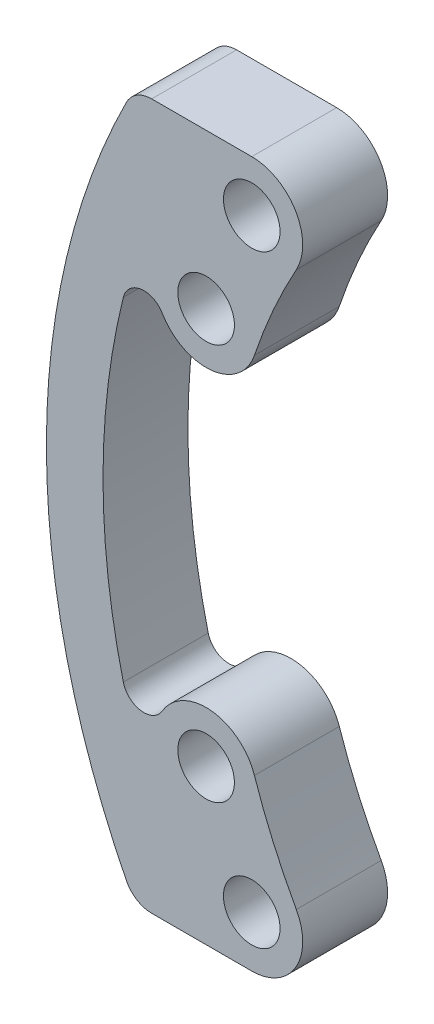
ISO-10303-21;
HEADER;
FILE_DESCRIPTION(('STEP AP214'),'2;1');
FILE_NAME('part.step','',(''),(''),'','','');
FILE_SCHEMA(('AUTOMOTIVE_DESIGN { 1 0 10303 214 1 1 1 1 }'));
ENDSEC;
DATA;
#1=APPLICATION_CONTEXT('core data for automotive mechanical design processes');
#2=APPLICATION_PROTOCOL_DEFINITION('international standard','automotive_design',2000,#1);
#3=PRODUCT_CONTEXT('',#1,'mechanical');
#4=PRODUCT('Part','Part','',(#3));
#5=PRODUCT_RELATED_PRODUCT_CATEGORY('part','',(#4));
#6=PRODUCT_DEFINITION_FORMATION('','',#4);
#7=PRODUCT_DEFINITION_CONTEXT('part definition',#1,'design');
#8=PRODUCT_DEFINITION('design','',#6,#7);
#9=PRODUCT_DEFINITION_SHAPE('','',#8);
#10=(LENGTH_UNIT() NAMED_UNIT(*) SI_UNIT(.MILLI.,.METRE.));
#11=(NAMED_UNIT(*) PLANE_ANGLE_UNIT() SI_UNIT($,.RADIAN.));
#12=(NAMED_UNIT(*) SI_UNIT($,.STERADIAN.) SOLID_ANGLE_UNIT());
#13=UNCERTAINTY_MEASURE_WITH_UNIT(LENGTH_MEASURE(1.E-05),#10,'distance_accuracy_value','');
#14=(GEOMETRIC_REPRESENTATION_CONTEXT(3) GLOBAL_UNCERTAINTY_ASSIGNED_CONTEXT((#13)) GLOBAL_UNIT_ASSIGNED_CONTEXT((#10,
#11,#12)) REPRESENTATION_CONTEXT('',''));
#15=CARTESIAN_POINT('',(0.,0.,0.));
#16=DIRECTION('',(0.,0.,1.));
#17=DIRECTION('',(1.,0.,0.));
#18=AXIS2_PLACEMENT_3D('',#15,#16,#17);
#19=CARTESIAN_POINT('',(-19.2444583804764,10.660713936792,1.5));
#20=DIRECTION('',(0.,0.,-1.));
#21=DIRECTION('',(-1.,0.,0.));
#22=AXIS2_PLACEMENT_3D('',#19,#20,#21);
#23=CYLINDRICAL_SURFACE('',#22,1.8);
#24=DIRECTION('',(0.,0.,1.));
#25=VECTOR('',#24,1.);
#26=CARTESIAN_POINT('',(-19.2444583804764,12.460713936792,-1.5));
#27=LINE('',#26,#25);
#28=CARTESIAN_POINT('',(-19.2444583804764,12.460713936792,-1.5));
#29=VERTEX_POINT('',#28);
#30=CARTESIAN_POINT('',(-19.2444583804764,12.460713936792,1.5));
#31=VERTEX_POINT('',#30);
#32=EDGE_CURVE('E187',#29,#31,#27,.T.);
#33=ORIENTED_EDGE('',*,*,#32,.T.);
#34=CARTESIAN_POINT('',(-19.2444583804764,10.660713936792,1.5));
#35=DIRECTION('',(0.,0.,1.));
#36=DIRECTION('',(1.,0.,0.));
#37=AXIS2_PLACEMENT_3D('',#34,#35,#36);
#38=CIRCLE('',#37,1.8);
#39=CARTESIAN_POINT('',(-17.6699117857101,9.78847370559995,1.5));
#40=VERTEX_POINT('',#39);
#41=EDGE_CURVE('E224',#40,#31,#38,.T.);
#42=ORIENTED_EDGE('',*,*,#41,.F.);
#43=DIRECTION('',(0.,0.,-1.));
#44=VECTOR('',#43,1.);
#45=CARTESIAN_POINT('',(-17.6699117857101,9.78847370559995,1.5));
#46=LINE('',#45,#44);
#47=CARTESIAN_POINT('',(-17.6699117857101,9.78847370559995,-1.5));
#48=VERTEX_POINT('',#47);
#49=EDGE_CURVE('E232',#40,#48,#46,.T.);
#50=ORIENTED_EDGE('',*,*,#49,.T.);
#51=CARTESIAN_POINT('',(-19.2444583804764,10.660713936792,-1.5));
#52=DIRECTION('',(0.,0.,1.));
#53=DIRECTION('',(1.,0.,0.));
#54=AXIS2_PLACEMENT_3D('',#51,#52,#53);
#55=CIRCLE('',#54,1.8);
#56=EDGE_CURVE('E221',#48,#29,#55,.T.);
#57=ORIENTED_EDGE('',*,*,#56,.T.);
#58=EDGE_LOOP('',(#33,#42,#50,#57));
#59=FACE_BOUND('',#58,.T.);
#60=ADVANCED_FACE('F33',(#59),#23,.T.);
#61=CARTESIAN_POINT('',(-20.8566536146142,7.,1.5));
#62=DIRECTION('',(0.,0.,-1.));
#63=DIRECTION('',(-1.,0.,0.));
#64=AXIS2_PLACEMENT_3D('',#61,#62,#63);
#65=CYLINDRICAL_SURFACE('',#64,1.8);
#66=DIRECTION('',(0.,0.,1.));
#67=VECTOR('',#66,1.);
#68=CARTESIAN_POINT('',(-22.4078937734295,6.08695346795534,-1.5));
#69=LINE('',#68,#67);
#70=CARTESIAN_POINT('',(-22.4078937734295,6.08695346795534,-1.5));
#71=VERTEX_POINT('',#70);
#72=CARTESIAN_POINT('',(-22.4078937734295,6.08695346795534,1.5));
#73=VERTEX_POINT('',#72);
#74=EDGE_CURVE('E198',#71,#73,#69,.T.);
#75=ORIENTED_EDGE('',*,*,#74,.F.);
#76=CARTESIAN_POINT('',(-20.8566536146142,7.,-1.5));
#77=DIRECTION('',(0.,0.,1.));
#78=DIRECTION('',(1.,0.,0.));
#79=AXIS2_PLACEMENT_3D('',#76,#77,#78);
#80=CIRCLE('',#79,1.8);
#81=CARTESIAN_POINT('',(-19.1502001370549,6.42727272727273,-1.5));
#82=VERTEX_POINT('',#81);
#83=EDGE_CURVE('E235',#71,#82,#80,.T.);
#84=ORIENTED_EDGE('',*,*,#83,.T.);
#85=DIRECTION('',(0.,0.,-1.));
#86=VECTOR('',#85,1.);
#87=CARTESIAN_POINT('',(-19.1502001370549,6.42727272727273,1.5));
#88=LINE('',#87,#86);
#89=CARTESIAN_POINT('',(-19.1502001370549,6.42727272727273,1.5));
#90=VERTEX_POINT('',#89);
#91=EDGE_CURVE('E240',#90,#82,#88,.T.);
#92=ORIENTED_EDGE('',*,*,#91,.F.);
#93=CARTESIAN_POINT('',(-20.8566536146142,7.,1.5));
#94=DIRECTION('',(0.,0.,1.));
#95=DIRECTION('',(1.,0.,0.));
#96=AXIS2_PLACEMENT_3D('',#93,#94,#95);
#97=CIRCLE('',#96,1.8);
#98=EDGE_CURVE('E227',#73,#90,#97,.T.);
#99=ORIENTED_EDGE('',*,*,#98,.F.);
#100=EDGE_LOOP('',(#75,#84,#92,#99));
#101=FACE_BOUND('',#100,.T.);
#102=ADVANCED_FACE('F293',(#101),#65,.T.);
#103=CARTESIAN_POINT('',(-9.6222291902382,5.33035696839601,1.5));
#104=DIRECTION('',(0.,0.,1.));
#105=DIRECTION('',(1.,0.,0.));
#106=AXIS2_PLACEMENT_3D('',#103,#104,#105);
#107=PLANE('',#106);
#108=CARTESIAN_POINT('',(0.,0.,1.5));
#109=DIRECTION('',(0.,0.,1.));
#110=DIRECTION('',(1.,0.,0.));
#111=AXIS2_PLACEMENT_3D('',#108,#109,#110);
#112=CIRCLE('',#111,26.5);
#113=CARTESIAN_POINT('',(-23.6727319687809,11.9101536990192,1.5));
#114=VERTEX_POINT('',#113);
#115=CARTESIAN_POINT('',(-23.6727319687809,-11.9101536990192,1.5));
#116=VERTEX_POINT('',#115);
#117=EDGE_CURVE('E167',#114,#116,#112,.T.);
#118=ORIENTED_EDGE('',*,*,#117,.T.);
#119=CARTESIAN_POINT('',(-22.7794213284495,-11.460713936792,1.5));
#120=DIRECTION('',(0.,0.,1.));
#121=DIRECTION('',(1.,0.,0.));
#122=AXIS2_PLACEMENT_3D('',#119,#120,#121);
#123=CIRCLE('',#122,1.);
#124=CARTESIAN_POINT('',(-22.7794213284495,-12.460713936792,1.5));
#125=VERTEX_POINT('',#124);
#126=EDGE_CURVE('E250',#116,#125,#123,.T.);
#127=ORIENTED_EDGE('',*,*,#126,.T.);
#128=DIRECTION('',(1.,0.,0.));
#129=VECTOR('',#128,1.);
#130=CARTESIAN_POINT('',(-19.2444583804764,-12.460713936792,1.5));
#131=LINE('',#130,#129);
#132=CARTESIAN_POINT('',(-19.2444583804764,-12.460713936792,1.5));
#133=VERTEX_POINT('',#132);
#134=EDGE_CURVE('E144',#125,#133,#131,.T.);
#135=ORIENTED_EDGE('',*,*,#134,.T.);
#136=CARTESIAN_POINT('',(-19.2444583804764,-10.660713936792,1.5));
#137=DIRECTION('',(0.,0.,1.));
#138=DIRECTION('',(-1.,0.,0.));
#139=AXIS2_PLACEMENT_3D('',#136,#137,#138);
#140=CIRCLE('',#139,1.8);
#141=CARTESIAN_POINT('',(-17.6699117857101,-9.78847370559995,1.5));
#142=VERTEX_POINT('',#141);
#143=EDGE_CURVE('E136',#133,#142,#140,.T.);
#144=ORIENTED_EDGE('',*,*,#143,.T.);
#145=CARTESIAN_POINT('',(0.,0.,1.5));
#146=DIRECTION('',(0.,0.,-1.));
#147=DIRECTION('',(-1.,0.,0.));
#148=AXIS2_PLACEMENT_3D('',#145,#146,#147);
#149=CIRCLE('',#148,20.2);
#150=CARTESIAN_POINT('',(-19.1502001370549,-6.42727272727273,1.5));
#151=VERTEX_POINT('',#150);
#152=EDGE_CURVE('E142',#142,#151,#149,.T.);
#153=ORIENTED_EDGE('',*,*,#152,.T.);
#154=CARTESIAN_POINT('',(-20.8566536146142,-7.00000000000001,1.5));
#155=DIRECTION('',(0.,0.,1.));
#156=DIRECTION('',(-1.,0.,0.));
#157=AXIS2_PLACEMENT_3D('',#154,#155,#156);
#158=CIRCLE('',#157,1.8);
#159=CARTESIAN_POINT('',(-22.4078937734295,-6.08695346795535,1.5));
#160=VERTEX_POINT('',#159);
#161=EDGE_CURVE('E158',#151,#160,#158,.T.);
#162=ORIENTED_EDGE('',*,*,#161,.T.);
#163=CARTESIAN_POINT('',(-23.0542438396025,-5.70651741293674,1.5));
#164=DIRECTION('',(0.,0.,-1.));
#165=DIRECTION('',(1.,0.,0.));
#166=AXIS2_PLACEMENT_3D('',#163,#164,#165);
#167=CIRCLE('',#166,0.749999999999999);
#168=CARTESIAN_POINT('',(-23.7822725924321,-5.88672322597684,1.5));
#169=VERTEX_POINT('',#168);
#170=EDGE_CURVE('E191',#160,#169,#167,.T.);
#171=ORIENTED_EDGE('',*,*,#170,.T.);
#172=CARTESIAN_POINT('',(0.,0.,1.5));
#173=DIRECTION('',(0.,0.,-1.));
#174=DIRECTION('',(1.,0.,0.));
#175=AXIS2_PLACEMENT_3D('',#172,#173,#174);
#176=CIRCLE('',#175,24.5);
#177=CARTESIAN_POINT('',(-23.7822725924321,5.88672322597684,1.5));
#178=VERTEX_POINT('',#177);
#179=EDGE_CURVE('E194',#169,#178,#176,.T.);
#180=ORIENTED_EDGE('',*,*,#179,.T.);
#181=CARTESIAN_POINT('',(-23.0542438396025,5.70651741293673,1.5));
#182=DIRECTION('',(0.,0.,-1.));
#183=DIRECTION('',(1.,0.,0.));
#184=AXIS2_PLACEMENT_3D('',#181,#182,#183);
#185=CIRCLE('',#184,0.750000000000001);
#186=EDGE_CURVE('E175',#178,#73,#185,.T.);
#187=ORIENTED_EDGE('',*,*,#186,.T.);
#188=ORIENTED_EDGE('',*,*,#98,.T.);
#189=CARTESIAN_POINT('',(0.,0.,1.5));
#190=DIRECTION('',(0.,0.,-1.));
#191=DIRECTION('',(1.,0.,0.));
#192=AXIS2_PLACEMENT_3D('',#189,#190,#191);
#193=CIRCLE('',#192,20.2);
#194=EDGE_CURVE('E230',#90,#40,#193,.T.);
#195=ORIENTED_EDGE('',*,*,#194,.T.);
#196=ORIENTED_EDGE('',*,*,#41,.T.);
#197=DIRECTION('',(-1.,0.,0.));
#198=VECTOR('',#197,1.);
#199=CARTESIAN_POINT('',(-19.2444583804764,12.460713936792,1.5));
#200=LINE('',#199,#198);
#201=CARTESIAN_POINT('',(-22.7794213284495,12.460713936792,1.5));
#202=VERTEX_POINT('',#201);
#203=EDGE_CURVE('E164',#31,#202,#200,.T.);
#204=ORIENTED_EDGE('',*,*,#203,.T.);
#205=CARTESIAN_POINT('',(-22.7794213284495,11.460713936792,1.5));
#206=DIRECTION('',(0.,0.,1.));
#207=DIRECTION('',(1.,0.,0.));
#208=AXIS2_PLACEMENT_3D('',#205,#206,#207);
#209=CIRCLE('',#208,1.);
#210=EDGE_CURVE('E248',#202,#114,#209,.T.);
#211=ORIENTED_EDGE('',*,*,#210,.T.);
#212=EDGE_LOOP('',(#118,#127,#135,#144,#153,#162,#171,#180,#187,#188,#195,#196,#204,#211));
#213=FACE_BOUND('',#212,.T.);
#214=CARTESIAN_POINT('',(-19.2444583804764,10.660713936792,1.5));
#215=DIRECTION('',(0.,0.,1.));
#216=DIRECTION('',(1.,0.,0.));
#217=AXIS2_PLACEMENT_3D('',#214,#215,#216);
#218=CIRCLE('',#217,0.999999999999984);
#219=CARTESIAN_POINT('',(-18.2444583804764,10.660713936792,1.5));
#220=VERTEX_POINT('',#219);
#221=EDGE_CURVE('E218',#220,#220,#218,.T.);
#222=ORIENTED_EDGE('',*,*,#221,.F.);
#223=EDGE_LOOP('',(#222));
#224=FACE_BOUND('',#223,.T.);
#225=CARTESIAN_POINT('',(-20.8566536146142,7.,1.5));
#226=DIRECTION('',(0.,0.,1.));
#227=DIRECTION('',(1.,0.,0.));
#228=AXIS2_PLACEMENT_3D('',#225,#226,#227);
#229=CIRCLE('',#228,1.);
#230=CARTESIAN_POINT('',(-19.8566536146142,7.,1.5));
#231=VERTEX_POINT('',#230);
#232=EDGE_CURVE('E212',#231,#231,#229,.T.);
#233=ORIENTED_EDGE('',*,*,#232,.F.);
#234=EDGE_LOOP('',(#233));
#235=FACE_BOUND('',#234,.T.);
#236=CARTESIAN_POINT('',(-19.2444583804764,-10.660713936792,1.5));
#237=DIRECTION('',(0.,0.,1.));
#238=DIRECTION('',(-1.,0.,0.));
#239=AXIS2_PLACEMENT_3D('',#236,#237,#238);
#240=CIRCLE('',#239,0.999999999999984);
#241=CARTESIAN_POINT('',(-20.2444583804764,-10.660713936792,1.5));
#242=VERTEX_POINT('',#241);
#243=EDGE_CURVE('E266',#242,#242,#240,.T.);
#244=ORIENTED_EDGE('',*,*,#243,.F.);
#245=EDGE_LOOP('',(#244));
#246=FACE_BOUND('',#245,.T.);
#247=CARTESIAN_POINT('',(-20.8566536146142,-7.00000000000001,1.5));
#248=DIRECTION('',(0.,0.,1.));
#249=DIRECTION('',(-1.,0.,0.));
#250=AXIS2_PLACEMENT_3D('',#247,#248,#249);
#251=CIRCLE('',#250,1.);
#252=CARTESIAN_POINT('',(-21.8566536146142,-7.00000000000001,1.5));
#253=VERTEX_POINT('',#252);
#254=EDGE_CURVE('E361',#253,#253,#251,.T.);
#255=ORIENTED_EDGE('',*,*,#254,.F.);
#256=EDGE_LOOP('',(#255));
#257=FACE_BOUND('',#256,.T.);
#258=ADVANCED_FACE('F139',(#213,#224,#235,#246,#257),#107,.T.);
#259=CARTESIAN_POINT('',(-9.6222291902382,5.33035696839601,-1.5));
#260=DIRECTION('',(0.,0.,1.));
#261=DIRECTION('',(1.,0.,0.));
#262=AXIS2_PLACEMENT_3D('',#259,#260,#261);
#263=PLANE('',#262);
#264=DIRECTION('',(1.,0.,0.));
#265=VECTOR('',#264,1.);
#266=CARTESIAN_POINT('',(-19.2444583804764,-12.460713936792,-1.5));
#267=LINE('',#266,#265);
#268=CARTESIAN_POINT('',(-22.7794213284495,-12.460713936792,-1.5));
#269=VERTEX_POINT('',#268);
#270=CARTESIAN_POINT('',(-19.2444583804764,-12.460713936792,-1.5));
#271=VERTEX_POINT('',#270);
#272=EDGE_CURVE('E178',#269,#271,#267,.T.);
#273=ORIENTED_EDGE('',*,*,#272,.F.);
#274=CARTESIAN_POINT('',(-22.7794213284495,-11.460713936792,-1.5));
#275=DIRECTION('',(0.,0.,1.));
#276=DIRECTION('',(1.,0.,0.));
#277=AXIS2_PLACEMENT_3D('',#274,#275,#276);
#278=CIRCLE('',#277,1.);
#279=CARTESIAN_POINT('',(-23.6727319687809,-11.9101536990192,-1.5));
#280=VERTEX_POINT('',#279);
#281=EDGE_CURVE('E41',#269,#280,#278,.F.);
#282=ORIENTED_EDGE('',*,*,#281,.T.);
#283=CARTESIAN_POINT('',(0.,0.,-1.5));
#284=DIRECTION('',(0.,0.,1.));
#285=DIRECTION('',(1.,0.,0.));
#286=AXIS2_PLACEMENT_3D('',#283,#284,#285);
#287=CIRCLE('',#286,26.5);
#288=CARTESIAN_POINT('',(-23.6727319687809,11.9101536990192,-1.5));
#289=VERTEX_POINT('',#288);
#290=EDGE_CURVE('E174',#289,#280,#287,.T.);
#291=ORIENTED_EDGE('',*,*,#290,.F.);
#292=CARTESIAN_POINT('',(-22.7794213284495,11.460713936792,-1.5));
#293=DIRECTION('',(0.,0.,1.));
#294=DIRECTION('',(1.,0.,0.));
#295=AXIS2_PLACEMENT_3D('',#292,#293,#294);
#296=CIRCLE('',#295,1.);
#297=CARTESIAN_POINT('',(-22.7794213284495,12.460713936792,-1.5));
#298=VERTEX_POINT('',#297);
#299=EDGE_CURVE('E48',#289,#298,#296,.F.);
#300=ORIENTED_EDGE('',*,*,#299,.T.);
#301=DIRECTION('',(-1.,0.,0.));
#302=VECTOR('',#301,1.);
#303=CARTESIAN_POINT('',(-19.2444583804764,12.460713936792,-1.5));
#304=LINE('',#303,#302);
#305=EDGE_CURVE('E172',#29,#298,#304,.T.);
#306=ORIENTED_EDGE('',*,*,#305,.F.);
#307=ORIENTED_EDGE('',*,*,#56,.F.);
#308=CARTESIAN_POINT('',(0.,0.,-1.5));
#309=DIRECTION('',(0.,0.,-1.));
#310=DIRECTION('',(1.,0.,0.));
#311=AXIS2_PLACEMENT_3D('',#308,#309,#310);
#312=CIRCLE('',#311,20.2);
#313=EDGE_CURVE('E228',#82,#48,#312,.T.);
#314=ORIENTED_EDGE('',*,*,#313,.F.);
#315=ORIENTED_EDGE('',*,*,#83,.F.);
#316=CARTESIAN_POINT('',(-23.0542438396025,5.70651741293673,-1.5));
#317=DIRECTION('',(0.,0.,-1.));
#318=DIRECTION('',(1.,0.,0.));
#319=AXIS2_PLACEMENT_3D('',#316,#317,#318);
#320=CIRCLE('',#319,0.750000000000001);
#321=CARTESIAN_POINT('',(-23.7822725924321,5.88672322597684,-1.5));
#322=VERTEX_POINT('',#321);
#323=EDGE_CURVE('E186',#322,#71,#320,.T.);
#324=ORIENTED_EDGE('',*,*,#323,.F.);
#325=CARTESIAN_POINT('',(0.,0.,-1.5));
#326=DIRECTION('',(0.,0.,-1.));
#327=DIRECTION('',(1.,0.,0.));
#328=AXIS2_PLACEMENT_3D('',#325,#326,#327);
#329=CIRCLE('',#328,24.5);
#330=CARTESIAN_POINT('',(-23.7822725924321,-5.88672322597684,-1.5));
#331=VERTEX_POINT('',#330);
#332=EDGE_CURVE('E183',#331,#322,#329,.T.);
#333=ORIENTED_EDGE('',*,*,#332,.F.);
#334=CARTESIAN_POINT('',(-23.0542438396025,-5.70651741293674,-1.5));
#335=DIRECTION('',(0.,0.,-1.));
#336=DIRECTION('',(1.,0.,0.));
#337=AXIS2_PLACEMENT_3D('',#334,#335,#336);
#338=CIRCLE('',#337,0.749999999999999);
#339=CARTESIAN_POINT('',(-22.4078937734295,-6.08695346795535,-1.5));
#340=VERTEX_POINT('',#339);
#341=EDGE_CURVE('E180',#340,#331,#338,.T.);
#342=ORIENTED_EDGE('',*,*,#341,.F.);
#343=CARTESIAN_POINT('',(-20.8566536146142,-7.00000000000001,-1.5));
#344=DIRECTION('',(0.,0.,1.));
#345=DIRECTION('',(-1.,0.,0.));
#346=AXIS2_PLACEMENT_3D('',#343,#344,#345);
#347=CIRCLE('',#346,1.8);
#348=CARTESIAN_POINT('',(-19.1502001370549,-6.42727272727273,-1.5));
#349=VERTEX_POINT('',#348);
#350=EDGE_CURVE('E149',#349,#340,#347,.T.);
#351=ORIENTED_EDGE('',*,*,#350,.F.);
#352=CARTESIAN_POINT('',(0.,0.,-1.5));
#353=DIRECTION('',(0.,0.,-1.));
#354=DIRECTION('',(-1.,0.,0.));
#355=AXIS2_PLACEMENT_3D('',#352,#353,#354);
#356=CIRCLE('',#355,20.2);
#357=CARTESIAN_POINT('',(-17.6699117857101,-9.78847370559995,-1.5));
#358=VERTEX_POINT('',#357);
#359=EDGE_CURVE('E265',#358,#349,#356,.T.);
#360=ORIENTED_EDGE('',*,*,#359,.F.);
#361=CARTESIAN_POINT('',(-19.2444583804764,-10.660713936792,-1.5));
#362=DIRECTION('',(0.,0.,1.));
#363=DIRECTION('',(-1.,0.,0.));
#364=AXIS2_PLACEMENT_3D('',#361,#362,#363);
#365=CIRCLE('',#364,1.8);
#366=EDGE_CURVE('E162',#271,#358,#365,.T.);
#367=ORIENTED_EDGE('',*,*,#366,.F.);
#368=EDGE_LOOP('',(#273,#282,#291,#300,#306,#307,#314,#315,#324,#333,#342,#351,#360,#367));
#369=FACE_BOUND('',#368,.T.);
#370=CARTESIAN_POINT('',(-19.2444583804764,10.660713936792,-1.5));
#371=DIRECTION('',(0.,0.,1.));
#372=DIRECTION('',(1.,0.,0.));
#373=AXIS2_PLACEMENT_3D('',#370,#371,#372);
#374=CIRCLE('',#373,0.999999999999984);
#375=CARTESIAN_POINT('',(-18.2444583804764,10.660713936792,-1.5));
#376=VERTEX_POINT('',#375);
#377=EDGE_CURVE('E215',#376,#376,#374,.T.);
#378=ORIENTED_EDGE('',*,*,#377,.T.);
#379=EDGE_LOOP('',(#378));
#380=FACE_BOUND('',#379,.T.);
#381=CARTESIAN_POINT('',(-20.8566536146142,7.,-1.5));
#382=DIRECTION('',(0.,0.,1.));
#383=DIRECTION('',(1.,0.,0.));
#384=AXIS2_PLACEMENT_3D('',#381,#382,#383);
#385=CIRCLE('',#384,1.);
#386=CARTESIAN_POINT('',(-19.8566536146142,7.,-1.5));
#387=VERTEX_POINT('',#386);
#388=EDGE_CURVE('E201',#387,#387,#385,.T.);
#389=ORIENTED_EDGE('',*,*,#388,.T.);
#390=EDGE_LOOP('',(#389));
#391=FACE_BOUND('',#390,.T.);
#392=CARTESIAN_POINT('',(-19.2444583804764,-10.660713936792,-1.5));
#393=DIRECTION('',(0.,0.,1.));
#394=DIRECTION('',(-1.,0.,0.));
#395=AXIS2_PLACEMENT_3D('',#392,#393,#394);
#396=CIRCLE('',#395,0.999999999999984);
#397=CARTESIAN_POINT('',(-20.2444583804764,-10.660713936792,-1.5));
#398=VERTEX_POINT('',#397);
#399=EDGE_CURVE('E270',#398,#398,#396,.T.);
#400=ORIENTED_EDGE('',*,*,#399,.T.);
#401=EDGE_LOOP('',(#400));
#402=FACE_BOUND('',#401,.T.);
#403=CARTESIAN_POINT('',(-20.8566536146142,-7.00000000000001,-1.5));
#404=DIRECTION('',(0.,0.,1.));
#405=DIRECTION('',(-1.,0.,0.));
#406=AXIS2_PLACEMENT_3D('',#403,#404,#405);
#407=CIRCLE('',#406,1.);
#408=CARTESIAN_POINT('',(-21.8566536146142,-7.00000000000001,-1.5));
#409=VERTEX_POINT('',#408);
#410=EDGE_CURVE('E364',#409,#409,#407,.T.);
#411=ORIENTED_EDGE('',*,*,#410,.T.);
#412=EDGE_LOOP('',(#411));
#413=FACE_BOUND('',#412,.T.);
#414=ADVANCED_FACE('F254',(#369,#380,#391,#402,#413),#263,.F.);
#415=CARTESIAN_POINT('',(0.,0.,1.5));
#416=DIRECTION('',(0.,0.,-1.));
#417=DIRECTION('',(-1.,0.,0.));
#418=AXIS2_PLACEMENT_3D('',#415,#416,#417);
#419=CYLINDRICAL_SURFACE('',#418,20.2);
#420=ORIENTED_EDGE('',*,*,#313,.T.);
#421=ORIENTED_EDGE('',*,*,#49,.F.);
#422=ORIENTED_EDGE('',*,*,#194,.F.);
#423=ORIENTED_EDGE('',*,*,#91,.T.);
#424=EDGE_LOOP('',(#420,#421,#422,#423));
#425=FACE_BOUND('',#424,.T.);
#426=ADVANCED_FACE('F298',(#425),#419,.F.);
#427=CARTESIAN_POINT('',(-19.2444583804764,10.660713936792,1.5));
#428=DIRECTION('',(0.,0.,-1.));
#429=DIRECTION('',(-1.,0.,0.));
#430=AXIS2_PLACEMENT_3D('',#427,#428,#429);
#431=CYLINDRICAL_SURFACE('',#430,0.999999999999984);
#432=ORIENTED_EDGE('',*,*,#221,.T.);
#433=EDGE_LOOP('',(#432));
#434=FACE_BOUND('',#433,.T.);
#435=ORIENTED_EDGE('',*,*,#377,.F.);
#436=EDGE_LOOP('',(#435));
#437=FACE_BOUND('',#436,.T.);
#438=ADVANCED_FACE('F320',(#434,#437),#431,.F.);
#439=CARTESIAN_POINT('',(-20.8566536146142,7.,1.5));
#440=DIRECTION('',(0.,0.,-1.));
#441=DIRECTION('',(-1.,0.,0.));
#442=AXIS2_PLACEMENT_3D('',#439,#440,#441);
#443=CYLINDRICAL_SURFACE('',#442,1.);
#444=ORIENTED_EDGE('',*,*,#232,.T.);
#445=EDGE_LOOP('',(#444));
#446=FACE_BOUND('',#445,.T.);
#447=ORIENTED_EDGE('',*,*,#388,.F.);
#448=EDGE_LOOP('',(#447));
#449=FACE_BOUND('',#448,.T.);
#450=ADVANCED_FACE('F327',(#446,#449),#443,.F.);
#451=CARTESIAN_POINT('',(-23.0542438396025,5.70651741293673,-1.5));
#452=DIRECTION('',(0.,0.,1.));
#453=DIRECTION('',(1.,0.,0.));
#454=AXIS2_PLACEMENT_3D('',#451,#452,#453);
#455=CYLINDRICAL_SURFACE('',#454,0.750000000000001);
#456=ORIENTED_EDGE('',*,*,#186,.F.);
#457=DIRECTION('',(0.,0.,1.));
#458=VECTOR('',#457,1.);
#459=CARTESIAN_POINT('',(-23.7822725924321,5.88672322597684,-1.5));
#460=LINE('',#459,#458);
#461=EDGE_CURVE('E202',#322,#178,#460,.T.);
#462=ORIENTED_EDGE('',*,*,#461,.F.);
#463=ORIENTED_EDGE('',*,*,#323,.T.);
#464=ORIENTED_EDGE('',*,*,#74,.T.);
#465=EDGE_LOOP('',(#456,#462,#463,#464));
#466=FACE_BOUND('',#465,.T.);
#467=ADVANCED_FACE('F288',(#466),#455,.F.);
#468=CARTESIAN_POINT('',(0.,0.,-1.5));
#469=DIRECTION('',(0.,0.,1.));
#470=DIRECTION('',(1.,0.,0.));
#471=AXIS2_PLACEMENT_3D('',#468,#469,#470);
#472=CYLINDRICAL_SURFACE('',#471,24.5);
#473=ORIENTED_EDGE('',*,*,#179,.F.);
#474=DIRECTION('',(0.,0.,1.));
#475=VECTOR('',#474,1.);
#476=CARTESIAN_POINT('',(-23.7822725924321,-5.88672322597684,-1.5));
#477=LINE('',#476,#475);
#478=EDGE_CURVE('E204',#331,#169,#477,.T.);
#479=ORIENTED_EDGE('',*,*,#478,.F.);
#480=ORIENTED_EDGE('',*,*,#332,.T.);
#481=ORIENTED_EDGE('',*,*,#461,.T.);
#482=EDGE_LOOP('',(#473,#479,#480,#481));
#483=FACE_BOUND('',#482,.T.);
#484=ADVANCED_FACE('F285',(#483),#472,.F.);
#485=CARTESIAN_POINT('',(-23.0542438396025,-5.70651741293674,-1.5));
#486=DIRECTION('',(0.,0.,1.));
#487=DIRECTION('',(1.,0.,0.));
#488=AXIS2_PLACEMENT_3D('',#485,#486,#487);
#489=CYLINDRICAL_SURFACE('',#488,0.749999999999999);
#490=ORIENTED_EDGE('',*,*,#170,.F.);
#491=DIRECTION('',(0.,0.,1.));
#492=VECTOR('',#491,1.);
#493=CARTESIAN_POINT('',(-22.4078937734295,-6.08695346795534,-1.5));
#494=LINE('',#493,#492);
#495=EDGE_CURVE('E206',#340,#160,#494,.T.);
#496=ORIENTED_EDGE('',*,*,#495,.F.);
#497=ORIENTED_EDGE('',*,*,#341,.T.);
#498=ORIENTED_EDGE('',*,*,#478,.T.);
#499=EDGE_LOOP('',(#490,#496,#497,#498));
#500=FACE_BOUND('',#499,.T.);
#501=ADVANCED_FACE('F279',(#500),#489,.F.);
#502=CARTESIAN_POINT('',(-19.2444583804764,-12.460713936792,-1.5));
#503=DIRECTION('',(0.,-1.,0.));
#504=DIRECTION('',(0.,0.,-1.));
#505=AXIS2_PLACEMENT_3D('',#502,#503,#504);
#506=PLANE('',#505);
#507=ORIENTED_EDGE('',*,*,#134,.F.);
#508=DIRECTION('',(0.,0.,1.));
#509=VECTOR('',#508,1.);
#510=CARTESIAN_POINT('',(-22.7794213284495,-12.460713936792,-1.5));
#511=LINE('',#510,#509);
#512=EDGE_CURVE('E56',#125,#269,#511,.F.);
#513=ORIENTED_EDGE('',*,*,#512,.T.);
#514=ORIENTED_EDGE('',*,*,#272,.T.);
#515=DIRECTION('',(0.,0.,1.));
#516=VECTOR('',#515,1.);
#517=CARTESIAN_POINT('',(-19.2444583804764,-12.460713936792,-1.5));
#518=LINE('',#517,#516);
#519=EDGE_CURVE('E208',#271,#133,#518,.T.);
#520=ORIENTED_EDGE('',*,*,#519,.T.);
#521=EDGE_LOOP('',(#507,#513,#514,#520));
#522=FACE_BOUND('',#521,.T.);
#523=ADVANCED_FACE('F263',(#522),#506,.T.);
#524=CARTESIAN_POINT('',(0.,0.,-1.5));
#525=DIRECTION('',(0.,0.,1.));
#526=DIRECTION('',(1.,0.,0.));
#527=AXIS2_PLACEMENT_3D('',#524,#525,#526);
#528=CYLINDRICAL_SURFACE('',#527,26.5);
#529=ORIENTED_EDGE('',*,*,#290,.T.);
#530=DIRECTION('',(0.,0.,1.));
#531=VECTOR('',#530,1.);
#532=CARTESIAN_POINT('',(-23.6727319687809,-11.9101536990192,-1.5));
#533=LINE('',#532,#531);
#534=EDGE_CURVE('E245',#280,#116,#533,.T.);
#535=ORIENTED_EDGE('',*,*,#534,.T.);
#536=ORIENTED_EDGE('',*,*,#117,.F.);
#537=DIRECTION('',(0.,0.,1.));
#538=VECTOR('',#537,1.);
#539=CARTESIAN_POINT('',(-23.6727319687809,11.9101536990192,-1.5));
#540=LINE('',#539,#538);
#541=EDGE_CURVE('E243',#114,#289,#540,.F.);
#542=ORIENTED_EDGE('',*,*,#541,.T.);
#543=EDGE_LOOP('',(#529,#535,#536,#542));
#544=FACE_BOUND('',#543,.T.);
#545=ADVANCED_FACE('F259',(#544),#528,.T.);
#546=CARTESIAN_POINT('',(-19.2444583804764,12.460713936792,-1.5));
#547=DIRECTION('',(0.,1.,0.));
#548=DIRECTION('',(-1.,0.,0.));
#549=AXIS2_PLACEMENT_3D('',#546,#547,#548);
#550=PLANE('',#549);
#551=ORIENTED_EDGE('',*,*,#305,.T.);
#552=DIRECTION('',(0.,0.,1.));
#553=VECTOR('',#552,1.);
#554=CARTESIAN_POINT('',(-22.7794213284495,12.460713936792,-1.5));
#555=LINE('',#554,#553);
#556=EDGE_CURVE('E11',#298,#202,#555,.T.);
#557=ORIENTED_EDGE('',*,*,#556,.T.);
#558=ORIENTED_EDGE('',*,*,#203,.F.);
#559=ORIENTED_EDGE('',*,*,#32,.F.);
#560=EDGE_LOOP('',(#551,#557,#558,#559));
#561=FACE_BOUND('',#560,.T.);
#562=ADVANCED_FACE('F303',(#561),#550,.T.);
#563=CARTESIAN_POINT('',(-19.2444583804764,-10.660713936792,1.5));
#564=DIRECTION('',(0.,0.,-1.));
#565=DIRECTION('',(-1.,0.,0.));
#566=AXIS2_PLACEMENT_3D('',#563,#564,#565);
#567=CYLINDRICAL_SURFACE('',#566,1.8);
#568=ORIENTED_EDGE('',*,*,#519,.F.);
#569=ORIENTED_EDGE('',*,*,#366,.T.);
#570=DIRECTION('',(0.,0.,-1.));
#571=VECTOR('',#570,1.);
#572=CARTESIAN_POINT('',(-17.6699117857101,-9.78847370559995,1.5));
#573=LINE('',#572,#571);
#574=EDGE_CURVE('E154',#142,#358,#573,.T.);
#575=ORIENTED_EDGE('',*,*,#574,.F.);
#576=ORIENTED_EDGE('',*,*,#143,.F.);
#577=EDGE_LOOP('',(#568,#569,#575,#576));
#578=FACE_BOUND('',#577,.T.);
#579=ADVANCED_FACE('F160',(#578),#567,.T.);
#580=CARTESIAN_POINT('',(0.,0.,1.5));
#581=DIRECTION('',(0.,0.,-1.));
#582=DIRECTION('',(-1.,0.,0.));
#583=AXIS2_PLACEMENT_3D('',#580,#581,#582);
#584=CYLINDRICAL_SURFACE('',#583,20.2);
#585=ORIENTED_EDGE('',*,*,#359,.T.);
#586=DIRECTION('',(0.,0.,-1.));
#587=VECTOR('',#586,1.);
#588=CARTESIAN_POINT('',(-19.1502001370549,-6.42727272727273,1.5));
#589=LINE('',#588,#587);
#590=EDGE_CURVE('E156',#151,#349,#589,.T.);
#591=ORIENTED_EDGE('',*,*,#590,.F.);
#592=ORIENTED_EDGE('',*,*,#152,.F.);
#593=ORIENTED_EDGE('',*,*,#574,.T.);
#594=EDGE_LOOP('',(#585,#591,#592,#593));
#595=FACE_BOUND('',#594,.T.);
#596=ADVANCED_FACE('F153',(#595),#584,.F.);
#597=CARTESIAN_POINT('',(-20.8566536146142,-7.00000000000001,1.5));
#598=DIRECTION('',(0.,0.,-1.));
#599=DIRECTION('',(-1.,0.,0.));
#600=AXIS2_PLACEMENT_3D('',#597,#598,#599);
#601=CYLINDRICAL_SURFACE('',#600,1.8);
#602=ORIENTED_EDGE('',*,*,#495,.T.);
#603=ORIENTED_EDGE('',*,*,#161,.F.);
#604=ORIENTED_EDGE('',*,*,#590,.T.);
#605=ORIENTED_EDGE('',*,*,#350,.T.);
#606=EDGE_LOOP('',(#602,#603,#604,#605));
#607=FACE_BOUND('',#606,.T.);
#608=ADVANCED_FACE('F275',(#607),#601,.T.);
#609=CARTESIAN_POINT('',(-19.2444583804764,-10.660713936792,1.5));
#610=DIRECTION('',(0.,0.,-1.));
#611=DIRECTION('',(-1.,0.,0.));
#612=AXIS2_PLACEMENT_3D('',#609,#610,#611);
#613=CYLINDRICAL_SURFACE('',#612,0.999999999999984);
#614=ORIENTED_EDGE('',*,*,#243,.T.);
#615=EDGE_LOOP('',(#614));
#616=FACE_BOUND('',#615,.T.);
#617=ORIENTED_EDGE('',*,*,#399,.F.);
#618=EDGE_LOOP('',(#617));
#619=FACE_BOUND('',#618,.T.);
#620=ADVANCED_FACE('F350',(#616,#619),#613,.F.);
#621=CARTESIAN_POINT('',(-20.8566536146142,-7.00000000000001,1.5));
#622=DIRECTION('',(0.,0.,-1.));
#623=DIRECTION('',(-1.,0.,0.));
#624=AXIS2_PLACEMENT_3D('',#621,#622,#623);
#625=CYLINDRICAL_SURFACE('',#624,1.);
#626=ORIENTED_EDGE('',*,*,#254,.T.);
#627=EDGE_LOOP('',(#626));
#628=FACE_BOUND('',#627,.T.);
#629=ORIENTED_EDGE('',*,*,#410,.F.);
#630=EDGE_LOOP('',(#629));
#631=FACE_BOUND('',#630,.T.);
#632=ADVANCED_FACE('F310',(#628,#631),#625,.F.);
#633=CARTESIAN_POINT('',(-22.7794213284495,-11.460713936792,-1.5));
#634=DIRECTION('',(0.,0.,1.));
#635=DIRECTION('',(1.,0.,0.));
#636=AXIS2_PLACEMENT_3D('',#633,#634,#635);
#637=CYLINDRICAL_SURFACE('',#636,1.);
#638=ORIENTED_EDGE('',*,*,#281,.F.);
#639=ORIENTED_EDGE('',*,*,#512,.F.);
#640=ORIENTED_EDGE('',*,*,#126,.F.);
#641=ORIENTED_EDGE('',*,*,#534,.F.);
#642=EDGE_LOOP('',(#638,#639,#640,#641));
#643=FACE_BOUND('',#642,.T.);
#644=ADVANCED_FACE('F262',(#643),#637,.T.);
#645=CARTESIAN_POINT('',(-22.7794213284495,11.460713936792,-1.5));
#646=DIRECTION('',(0.,0.,1.));
#647=DIRECTION('',(1.,0.,0.));
#648=AXIS2_PLACEMENT_3D('',#645,#646,#647);
#649=CYLINDRICAL_SURFACE('',#648,1.);
#650=ORIENTED_EDGE('',*,*,#299,.F.);
#651=ORIENTED_EDGE('',*,*,#541,.F.);
#652=ORIENTED_EDGE('',*,*,#210,.F.);
#653=ORIENTED_EDGE('',*,*,#556,.F.);
#654=EDGE_LOOP('',(#650,#651,#652,#653));
#655=FACE_BOUND('',#654,.T.);
#656=ADVANCED_FACE('F35',(#655),#649,.T.);
#657=CLOSED_SHELL('',(#60,#102,#258,#414,#426,#438,#450,#467,#484,#501,#523,#545,#562,#579,#596,
#608,#620,#632,#644,#656));
#658=MANIFOLD_SOLID_BREP('B2',#657);
#659=ADVANCED_BREP_SHAPE_REPRESENTATION('',(#18,#658),#14);
#660=SHAPE_DEFINITION_REPRESENTATION(#9,#659);
ENDSEC;
END-ISO-10303-21;
